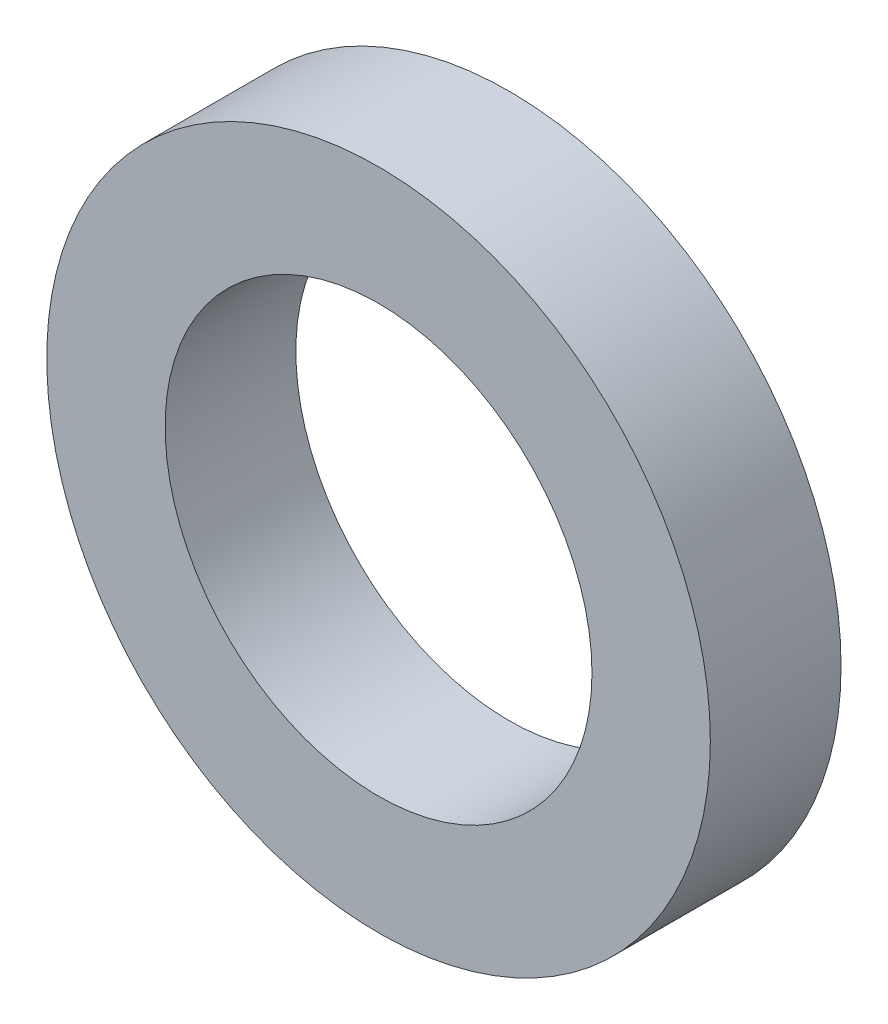
ISO-10303-21;
HEADER;
FILE_DESCRIPTION(('STEP AP214'),'2;1');
FILE_NAME('part.step','',(''),(''),'','','');
FILE_SCHEMA(('AUTOMOTIVE_DESIGN { 1 0 10303 214 1 1 1 1 }'));
ENDSEC;
DATA;
#1=APPLICATION_CONTEXT('core data for automotive mechanical design processes');
#2=APPLICATION_PROTOCOL_DEFINITION('international standard','automotive_design',2000,#1);
#3=PRODUCT_CONTEXT('',#1,'mechanical');
#4=PRODUCT('Part','Part','',(#3));
#5=PRODUCT_RELATED_PRODUCT_CATEGORY('part','',(#4));
#6=PRODUCT_DEFINITION_FORMATION('','',#4);
#7=PRODUCT_DEFINITION_CONTEXT('part definition',#1,'design');
#8=PRODUCT_DEFINITION('design','',#6,#7);
#9=PRODUCT_DEFINITION_SHAPE('','',#8);
#10=(LENGTH_UNIT() NAMED_UNIT(*) SI_UNIT(.MILLI.,.METRE.));
#11=(NAMED_UNIT(*) PLANE_ANGLE_UNIT() SI_UNIT($,.RADIAN.));
#12=(NAMED_UNIT(*) SI_UNIT($,.STERADIAN.) SOLID_ANGLE_UNIT());
#13=UNCERTAINTY_MEASURE_WITH_UNIT(LENGTH_MEASURE(1.E-05),#10,'distance_accuracy_value','');
#14=(GEOMETRIC_REPRESENTATION_CONTEXT(3) GLOBAL_UNCERTAINTY_ASSIGNED_CONTEXT((#13)) GLOBAL_UNIT_ASSIGNED_CONTEXT((#10,
#11,#12)) REPRESENTATION_CONTEXT('',''));
#15=CARTESIAN_POINT('',(0.,0.,0.));
#16=DIRECTION('',(0.,0.,1.));
#17=DIRECTION('',(1.,0.,0.));
#18=AXIS2_PLACEMENT_3D('',#15,#16,#17);
#19=CARTESIAN_POINT('',(164.79980395356,1350.51395299235,13.97));
#20=DIRECTION('',(0.,0.,1.));
#21=DIRECTION('',(1.,0.,0.));
#22=AXIS2_PLACEMENT_3D('',#19,#20,#21);
#23=PLANE('',#22);
#24=CARTESIAN_POINT('',(164.79980395356,1350.51395299235,13.97));
#25=DIRECTION('',(0.,0.,1.));
#26=DIRECTION('',(1.,0.,0.));
#27=AXIS2_PLACEMENT_3D('',#24,#25,#26);
#28=CIRCLE('',#27,35.4584000000001);
#29=CARTESIAN_POINT('',(200.25820395356,1350.51395299235,13.97));
#30=VERTEX_POINT('',#29);
#31=EDGE_CURVE('E12',#30,#30,#28,.T.);
#32=ORIENTED_EDGE('',*,*,#31,.T.);
#33=EDGE_LOOP('',(#32));
#34=FACE_BOUND('',#33,.T.);
#35=CARTESIAN_POINT('',(164.79980395356,1350.51395299235,13.97));
#36=DIRECTION('',(0.,0.,1.));
#37=DIRECTION('',(1.,0.,0.));
#38=AXIS2_PLACEMENT_3D('',#35,#36,#37);
#39=CIRCLE('',#38,22.8092000000001);
#40=CARTESIAN_POINT('',(187.60900395356,1350.51395299235,13.97));
#41=VERTEX_POINT('',#40);
#42=EDGE_CURVE('E55',#41,#41,#39,.T.);
#43=ORIENTED_EDGE('',*,*,#42,.F.);
#44=EDGE_LOOP('',(#43));
#45=FACE_BOUND('',#44,.T.);
#46=ADVANCED_FACE('F44',(#34,#45),#23,.T.);
#47=CARTESIAN_POINT('',(164.79980395356,1350.51395299235,0.));
#48=DIRECTION('',(0.,0.,1.));
#49=DIRECTION('',(1.,0.,0.));
#50=AXIS2_PLACEMENT_3D('',#47,#48,#49);
#51=PLANE('',#50);
#52=CARTESIAN_POINT('',(164.79980395356,1350.51395299235,0.));
#53=DIRECTION('',(0.,0.,1.));
#54=DIRECTION('',(1.,0.,0.));
#55=AXIS2_PLACEMENT_3D('',#52,#53,#54);
#56=CIRCLE('',#55,35.4584000000001);
#57=CARTESIAN_POINT('',(200.25820395356,1350.51395299235,0.));
#58=VERTEX_POINT('',#57);
#59=EDGE_CURVE('E48',#58,#58,#56,.T.);
#60=ORIENTED_EDGE('',*,*,#59,.F.);
#61=EDGE_LOOP('',(#60));
#62=FACE_BOUND('',#61,.T.);
#63=CARTESIAN_POINT('',(164.79980395356,1350.51395299235,0.));
#64=DIRECTION('',(0.,0.,1.));
#65=DIRECTION('',(1.,0.,0.));
#66=AXIS2_PLACEMENT_3D('',#63,#64,#65);
#67=CIRCLE('',#66,22.8092000000001);
#68=CARTESIAN_POINT('',(187.60900395356,1350.51395299235,0.));
#69=VERTEX_POINT('',#68);
#70=EDGE_CURVE('E57',#69,#69,#67,.T.);
#71=ORIENTED_EDGE('',*,*,#70,.T.);
#72=EDGE_LOOP('',(#71));
#73=FACE_BOUND('',#72,.T.);
#74=ADVANCED_FACE('F67',(#62,#73),#51,.F.);
#75=CARTESIAN_POINT('',(164.79980395356,1350.51395299235,13.97));
#76=DIRECTION('',(0.,0.,-1.));
#77=DIRECTION('',(-1.,0.,0.));
#78=AXIS2_PLACEMENT_3D('',#75,#76,#77);
#79=CYLINDRICAL_SURFACE('',#78,35.4584000000001);
#80=ORIENTED_EDGE('',*,*,#31,.F.);
#81=EDGE_LOOP('',(#80));
#82=FACE_BOUND('',#81,.T.);
#83=ORIENTED_EDGE('',*,*,#59,.T.);
#84=EDGE_LOOP('',(#83));
#85=FACE_BOUND('',#84,.T.);
#86=ADVANCED_FACE('F46',(#82,#85),#79,.T.);
#87=CARTESIAN_POINT('',(164.79980395356,1350.51395299235,13.97));
#88=DIRECTION('',(0.,0.,-1.));
#89=DIRECTION('',(-1.,0.,0.));
#90=AXIS2_PLACEMENT_3D('',#87,#88,#89);
#91=CYLINDRICAL_SURFACE('',#90,22.8092000000001);
#92=ORIENTED_EDGE('',*,*,#42,.T.);
#93=EDGE_LOOP('',(#92));
#94=FACE_BOUND('',#93,.T.);
#95=ORIENTED_EDGE('',*,*,#70,.F.);
#96=EDGE_LOOP('',(#95));
#97=FACE_BOUND('',#96,.T.);
#98=ADVANCED_FACE('F63',(#94,#97),#91,.F.);
#99=CLOSED_SHELL('',(#46,#74,#86,#98));
#100=MANIFOLD_SOLID_BREP('B2',#99);
#101=ADVANCED_BREP_SHAPE_REPRESENTATION('',(#18,#100),#14);
#102=SHAPE_DEFINITION_REPRESENTATION(#9,#101);
ENDSEC;
END-ISO-10303-21;
